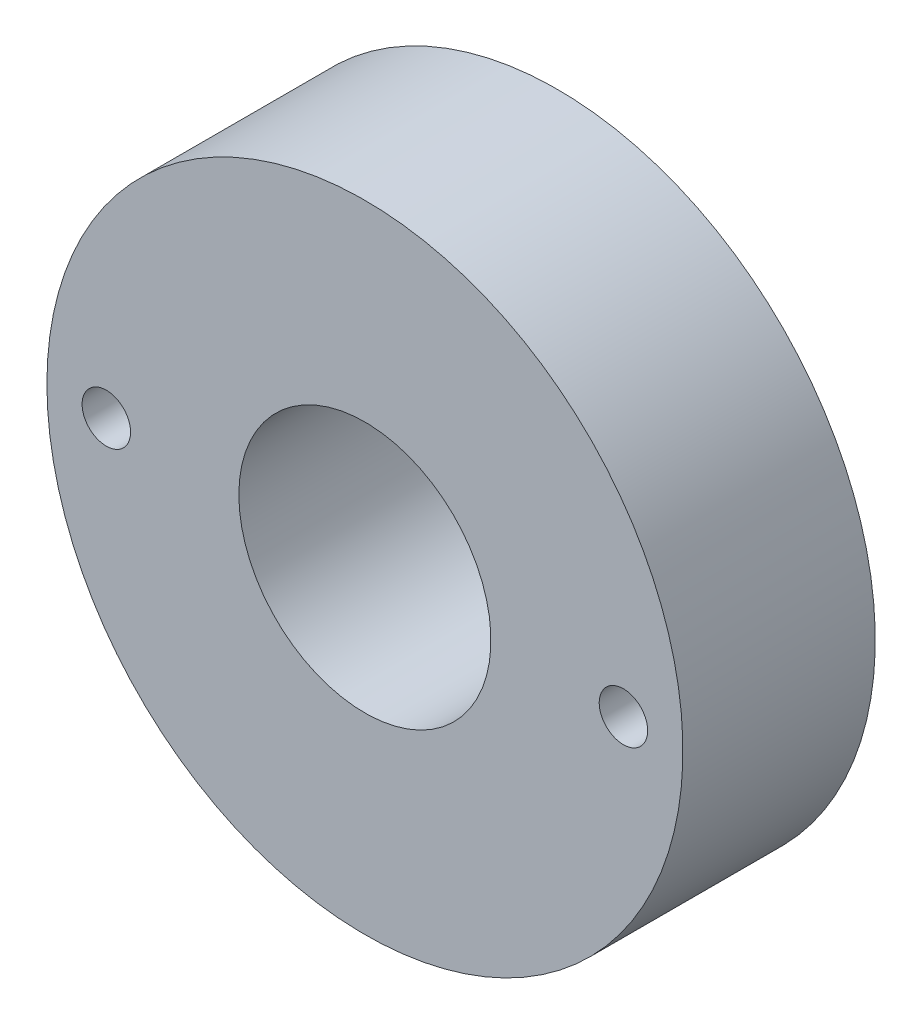
ISO-10303-21;
HEADER;
FILE_DESCRIPTION(('STEP AP214'),'2;1');
FILE_NAME('part.step','',(''),(''),'','','');
FILE_SCHEMA(('AUTOMOTIVE_DESIGN { 1 0 10303 214 1 1 1 1 }'));
ENDSEC;
DATA;
#1=APPLICATION_CONTEXT('core data for automotive mechanical design processes');
#2=APPLICATION_PROTOCOL_DEFINITION('international standard','automotive_design',2000,#1);
#3=PRODUCT_CONTEXT('',#1,'mechanical');
#4=PRODUCT('Part','Part','',(#3));
#5=PRODUCT_RELATED_PRODUCT_CATEGORY('part','',(#4));
#6=PRODUCT_DEFINITION_FORMATION('','',#4);
#7=PRODUCT_DEFINITION_CONTEXT('part definition',#1,'design');
#8=PRODUCT_DEFINITION('design','',#6,#7);
#9=PRODUCT_DEFINITION_SHAPE('','',#8);
#10=(LENGTH_UNIT() NAMED_UNIT(*) SI_UNIT(.MILLI.,.METRE.));
#11=(NAMED_UNIT(*) PLANE_ANGLE_UNIT() SI_UNIT($,.RADIAN.));
#12=(NAMED_UNIT(*) SI_UNIT($,.STERADIAN.) SOLID_ANGLE_UNIT());
#13=UNCERTAINTY_MEASURE_WITH_UNIT(LENGTH_MEASURE(1.E-05),#10,'distance_accuracy_value','');
#14=(GEOMETRIC_REPRESENTATION_CONTEXT(3) GLOBAL_UNCERTAINTY_ASSIGNED_CONTEXT((#13)) GLOBAL_UNIT_ASSIGNED_CONTEXT((#10,
#11,#12)) REPRESENTATION_CONTEXT('',''));
#15=CARTESIAN_POINT('',(0.,0.,0.));
#16=DIRECTION('',(0.,0.,1.));
#17=DIRECTION('',(1.,0.,0.));
#18=AXIS2_PLACEMENT_3D('',#15,#16,#17);
#19=CARTESIAN_POINT('',(657.422182148307,471.1394946,30.1752));
#20=DIRECTION('',(0.,0.,-1.));
#21=DIRECTION('',(-1.,0.,0.));
#22=AXIS2_PLACEMENT_3D('',#19,#20,#21);
#23=CYLINDRICAL_SURFACE('',#22,4.7625);
#24=CARTESIAN_POINT('',(657.422182148307,471.1394946,37.7952));
#25=DIRECTION('',(0.,0.,-1.));
#26=DIRECTION('',(-1.,0.,0.));
#27=AXIS2_PLACEMENT_3D('',#24,#25,#26);
#28=CIRCLE('',#27,4.7625);
#29=CARTESIAN_POINT('',(652.659682148307,471.1394946,37.7952));
#30=VERTEX_POINT('',#29);
#31=EDGE_CURVE('E113',#30,#30,#28,.T.);
#32=ORIENTED_EDGE('',*,*,#31,.F.);
#33=EDGE_LOOP('',(#32));
#34=FACE_BOUND('',#33,.T.);
#35=CARTESIAN_POINT('',(657.422182148307,471.1394946,30.1752));
#36=DIRECTION('',(0.,0.,-1.));
#37=DIRECTION('',(-1.,0.,0.));
#38=AXIS2_PLACEMENT_3D('',#35,#36,#37);
#39=CIRCLE('',#38,4.7625);
#40=CARTESIAN_POINT('',(652.659682148307,471.1394946,30.1752));
#41=VERTEX_POINT('',#40);
#42=EDGE_CURVE('E19',#41,#41,#39,.F.);
#43=ORIENTED_EDGE('',*,*,#42,.F.);
#44=EDGE_LOOP('',(#43));
#45=FACE_BOUND('',#44,.T.);
#46=ADVANCED_FACE('F16',(#34,#45),#23,.F.);
#47=CARTESIAN_POINT('',(555.822182148307,471.1394946,30.1752));
#48=DIRECTION('',(0.,0.,-1.));
#49=DIRECTION('',(-1.,0.,0.));
#50=AXIS2_PLACEMENT_3D('',#47,#48,#49);
#51=CYLINDRICAL_SURFACE('',#50,4.7625);
#52=CARTESIAN_POINT('',(555.822182148307,471.1394946,37.7952));
#53=DIRECTION('',(0.,0.,-1.));
#54=DIRECTION('',(-1.,0.,0.));
#55=AXIS2_PLACEMENT_3D('',#52,#53,#54);
#56=CIRCLE('',#55,4.7625);
#57=CARTESIAN_POINT('',(551.059682148307,471.1394946,37.7952));
#58=VERTEX_POINT('',#57);
#59=EDGE_CURVE('E110',#58,#58,#56,.T.);
#60=ORIENTED_EDGE('',*,*,#59,.F.);
#61=EDGE_LOOP('',(#60));
#62=FACE_BOUND('',#61,.T.);
#63=CARTESIAN_POINT('',(555.822182148307,471.1394946,30.1752));
#64=DIRECTION('',(0.,0.,-1.));
#65=DIRECTION('',(-1.,0.,0.));
#66=AXIS2_PLACEMENT_3D('',#63,#64,#65);
#67=CIRCLE('',#66,4.7625);
#68=CARTESIAN_POINT('',(551.059682148307,471.1394946,30.1752));
#69=VERTEX_POINT('',#68);
#70=EDGE_CURVE('E115',#69,#69,#67,.F.);
#71=ORIENTED_EDGE('',*,*,#70,.F.);
#72=EDGE_LOOP('',(#71));
#73=FACE_BOUND('',#72,.T.);
#74=ADVANCED_FACE('F126',(#62,#73),#51,.F.);
#75=CARTESIAN_POINT('',(657.422105948307,471.1394438,30.1751999999997));
#76=DIRECTION('',(0.,0.,1.));
#77=DIRECTION('',(1.,0.,0.));
#78=AXIS2_PLACEMENT_3D('',#75,#76,#77);
#79=PLANE('',#78);
#80=ORIENTED_EDGE('',*,*,#42,.T.);
#81=EDGE_LOOP('',(#80));
#82=FACE_BOUND('',#81,.T.);
#83=CARTESIAN_POINT('',(657.422029748307,471.1394946,30.1752));
#84=DIRECTION('',(0.,0.,-1.));
#85=DIRECTION('',(-1.,0.,0.));
#86=AXIS2_PLACEMENT_3D('',#83,#84,#85);
#87=CIRCLE('',#86,3.175);
#88=CARTESIAN_POINT('',(654.247029748307,471.1394946,30.1752));
#89=VERTEX_POINT('',#88);
#90=EDGE_CURVE('E106',#89,#89,#87,.T.);
#91=ORIENTED_EDGE('',*,*,#90,.T.);
#92=EDGE_LOOP('',(#91));
#93=FACE_BOUND('',#92,.T.);
#94=ADVANCED_FACE('F122',(#82,#93),#79,.T.);
#95=CARTESIAN_POINT('',(555.822182148307,471.1394946,30.1752));
#96=DIRECTION('',(0.,0.,1.));
#97=DIRECTION('',(1.,0.,0.));
#98=AXIS2_PLACEMENT_3D('',#95,#96,#97);
#99=PLANE('',#98);
#100=ORIENTED_EDGE('',*,*,#70,.T.);
#101=EDGE_LOOP('',(#100));
#102=FACE_BOUND('',#101,.T.);
#103=CARTESIAN_POINT('',(555.822182148307,471.1394946,30.1752));
#104=DIRECTION('',(0.,0.,1.));
#105=DIRECTION('',(1.,0.,0.));
#106=AXIS2_PLACEMENT_3D('',#103,#104,#105);
#107=CIRCLE('',#106,3.175);
#108=CARTESIAN_POINT('',(558.997182148307,471.1394946,30.1752));
#109=VERTEX_POINT('',#108);
#110=EDGE_CURVE('E103',#109,#109,#107,.F.);
#111=ORIENTED_EDGE('',*,*,#110,.T.);
#112=EDGE_LOOP('',(#111));
#113=FACE_BOUND('',#112,.T.);
#114=ADVANCED_FACE('F44',(#102,#113),#99,.T.);
#115=CARTESIAN_POINT('',(606.622232948307,532.26474700002,37.7952));
#116=DIRECTION('',(0.,0.,1.));
#117=DIRECTION('',(1.,0.,0.));
#118=AXIS2_PLACEMENT_3D('',#115,#116,#117);
#119=PLANE('',#118);
#120=ORIENTED_EDGE('',*,*,#59,.T.);
#121=EDGE_LOOP('',(#120));
#122=FACE_BOUND('',#121,.T.);
#123=ORIENTED_EDGE('',*,*,#31,.T.);
#124=EDGE_LOOP('',(#123));
#125=FACE_BOUND('',#124,.T.);
#126=CARTESIAN_POINT('',(606.622105948307,471.1394438,37.7952));
#127=DIRECTION('',(0.,0.,-1.));
#128=DIRECTION('',(-1.,0.,0.));
#129=AXIS2_PLACEMENT_3D('',#126,#127,#128);
#130=CIRCLE('',#129,24.7649238000521);
#131=CARTESIAN_POINT('',(581.857182148255,471.1394438,37.7952));
#132=VERTEX_POINT('',#131);
#133=EDGE_CURVE('E100',#132,#132,#130,.T.);
#134=ORIENTED_EDGE('',*,*,#133,.T.);
#135=EDGE_LOOP('',(#134));
#136=FACE_BOUND('',#135,.T.);
#137=CARTESIAN_POINT('',(606.6282,471.1393676,37.7952));
#138=DIRECTION('',(0.,0.,-1.));
#139=DIRECTION('',(-1.,0.,0.));
#140=AXIS2_PLACEMENT_3D('',#137,#138,#139);
#141=CIRCLE('',#140,62.484);
#142=CARTESIAN_POINT('',(544.1442,471.1393676,37.7952));
#143=VERTEX_POINT('',#142);
#144=EDGE_CURVE('E83',#143,#143,#141,.T.);
#145=ORIENTED_EDGE('',*,*,#144,.F.);
#146=EDGE_LOOP('',(#145));
#147=FACE_BOUND('',#146,.T.);
#148=ADVANCED_FACE('F34',(#122,#125,#136,#147),#119,.T.);
#149=CARTESIAN_POINT('',(606.622105948307,420.3394438,7.62002457634027));
#150=DIRECTION('',(0.,0.,-1.));
#151=DIRECTION('',(0.,1.,0.));
#152=AXIS2_PLACEMENT_3D('',#149,#150,#151);
#153=CONICAL_SURFACE('',#152,3.17499960539165,1.12395138465965);
#154=CARTESIAN_POINT('',(606.622105948307,420.3394438,7.62002793637213));
#155=DIRECTION('',(0.,0.,-1.));
#156=DIRECTION('',(0.,1.,0.));
#157=AXIS2_PLACEMENT_3D('',#154,#155,#156);
#158=CIRCLE('',#157,3.17499259319574);
#159=CARTESIAN_POINT('',(606.622105948307,423.514436393196,7.62002793637214));
#160=VERTEX_POINT('',#159);
#161=EDGE_CURVE('E95',#160,#160,#158,.T.);
#162=ORIENTED_EDGE('',*,*,#161,.T.);
#163=EDGE_LOOP('',(#162));
#164=FACE_BOUND('',#163,.T.);
#165=CARTESIAN_POINT('',(606.622105948307,420.339443799918,9.14138821100607));
#166=VERTEX_POINT('',#165);
#167=VERTEX_LOOP('',#166);
#168=FACE_BOUND('',#167,.T.);
#169=ADVANCED_FACE('F31',(#164,#168),#153,.F.);
#170=CARTESIAN_POINT('',(606.622182148307,521.9394946,7.6200254000014));
#171=DIRECTION('',(0.,0.,-1.));
#172=DIRECTION('',(0.,1.,0.));
#173=AXIS2_PLACEMENT_3D('',#170,#171,#172);
#174=CONICAL_SURFACE('',#173,3.17499788637372,1.12395138465357);
#175=CARTESIAN_POINT('',(606.622182148307,521.9394946,9.14138821099186));
#176=VERTEX_POINT('',#175);
#177=VERTEX_LOOP('',#176);
#178=FACE_BOUND('',#177,.T.);
#179=CARTESIAN_POINT('',(606.622182148307,521.9394946,7.62002793633195));
#180=DIRECTION('',(0.,0.,-1.));
#181=DIRECTION('',(0.,1.,0.));
#182=AXIS2_PLACEMENT_3D('',#179,#180,#181);
#183=CIRCLE('',#182,3.17499259319574);
#184=CARTESIAN_POINT('',(606.622182148307,525.114487193196,7.62002793633196));
#185=VERTEX_POINT('',#184);
#186=EDGE_CURVE('E89',#185,#185,#183,.T.);
#187=ORIENTED_EDGE('',*,*,#186,.T.);
#188=EDGE_LOOP('',(#187));
#189=FACE_BOUND('',#188,.T.);
#190=ADVANCED_FACE('F33',(#178,#189),#174,.F.);
#191=CARTESIAN_POINT('',(606.6282,471.1393676,0.));
#192=DIRECTION('',(0.,0.,-1.));
#193=DIRECTION('',(-1.,0.,0.));
#194=AXIS2_PLACEMENT_3D('',#191,#192,#193);
#195=CYLINDRICAL_SURFACE('',#194,62.484);
#196=ORIENTED_EDGE('',*,*,#144,.T.);
#197=EDGE_LOOP('',(#196));
#198=FACE_BOUND('',#197,.T.);
#199=CARTESIAN_POINT('',(606.6282,471.1393676,0.));
#200=DIRECTION('',(0.,0.,-1.));
#201=DIRECTION('',(-1.,0.,0.));
#202=AXIS2_PLACEMENT_3D('',#199,#200,#201);
#203=CIRCLE('',#202,62.484);
#204=CARTESIAN_POINT('',(544.1442,471.1393676,0.));
#205=VERTEX_POINT('',#204);
#206=EDGE_CURVE('E86',#205,#205,#203,.T.);
#207=ORIENTED_EDGE('',*,*,#206,.F.);
#208=EDGE_LOOP('',(#207));
#209=FACE_BOUND('',#208,.T.);
#210=ADVANCED_FACE('F42',(#198,#209),#195,.T.);
#211=CARTESIAN_POINT('',(657.422029748307,471.1394946,15.0876));
#212=DIRECTION('',(0.,0.,-1.));
#213=DIRECTION('',(-1.,0.,0.));
#214=AXIS2_PLACEMENT_3D('',#211,#212,#213);
#215=CYLINDRICAL_SURFACE('',#214,3.175);
#216=CARTESIAN_POINT('',(657.422029748307,471.1394946,0.));
#217=DIRECTION('',(0.,0.,-1.));
#218=DIRECTION('',(-1.,0.,0.));
#219=AXIS2_PLACEMENT_3D('',#216,#217,#218);
#220=CIRCLE('',#219,3.175);
#221=CARTESIAN_POINT('',(654.247029748307,471.1394946,0.));
#222=VERTEX_POINT('',#221);
#223=EDGE_CURVE('E88',#222,#222,#220,.F.);
#224=ORIENTED_EDGE('',*,*,#223,.F.);
#225=EDGE_LOOP('',(#224));
#226=FACE_BOUND('',#225,.T.);
#227=ORIENTED_EDGE('',*,*,#90,.F.);
#228=EDGE_LOOP('',(#227));
#229=FACE_BOUND('',#228,.T.);
#230=ADVANCED_FACE('F71',(#226,#229),#215,.F.);
#231=CARTESIAN_POINT('',(555.822182148307,471.1394946,15.0876));
#232=DIRECTION('',(0.,0.,1.));
#233=DIRECTION('',(1.,0.,0.));
#234=AXIS2_PLACEMENT_3D('',#231,#232,#233);
#235=CYLINDRICAL_SURFACE('',#234,3.175);
#236=CARTESIAN_POINT('',(555.822182148307,471.1394946,0.));
#237=DIRECTION('',(0.,0.,1.));
#238=DIRECTION('',(1.,0.,0.));
#239=AXIS2_PLACEMENT_3D('',#236,#237,#238);
#240=CIRCLE('',#239,3.175);
#241=CARTESIAN_POINT('',(558.997182148307,471.1394946,0.));
#242=VERTEX_POINT('',#241);
#243=EDGE_CURVE('E92',#242,#242,#240,.T.);
#244=ORIENTED_EDGE('',*,*,#243,.F.);
#245=EDGE_LOOP('',(#244));
#246=FACE_BOUND('',#245,.T.);
#247=ORIENTED_EDGE('',*,*,#110,.F.);
#248=EDGE_LOOP('',(#247));
#249=FACE_BOUND('',#248,.T.);
#250=ADVANCED_FACE('F67',(#246,#249),#235,.F.);
#251=CARTESIAN_POINT('',(606.622105948307,471.1394438,0.));
#252=DIRECTION('',(0.,0.,-1.));
#253=DIRECTION('',(-1.,0.,0.));
#254=AXIS2_PLACEMENT_3D('',#251,#252,#253);
#255=CYLINDRICAL_SURFACE('',#254,24.7649238000521);
#256=CARTESIAN_POINT('',(606.622105948307,471.1394438,0.));
#257=DIRECTION('',(0.,0.,-1.));
#258=DIRECTION('',(-1.,0.,0.));
#259=AXIS2_PLACEMENT_3D('',#256,#257,#258);
#260=CIRCLE('',#259,24.7649238000521);
#261=CARTESIAN_POINT('',(581.857182148255,471.1394438,0.));
#262=VERTEX_POINT('',#261);
#263=EDGE_CURVE('E206',#262,#262,#260,.F.);
#264=ORIENTED_EDGE('',*,*,#263,.F.);
#265=EDGE_LOOP('',(#264));
#266=FACE_BOUND('',#265,.T.);
#267=ORIENTED_EDGE('',*,*,#133,.F.);
#268=EDGE_LOOP('',(#267));
#269=FACE_BOUND('',#268,.T.);
#270=ADVANCED_FACE('F63',(#266,#269),#255,.F.);
#271=CARTESIAN_POINT('',(606.622105948307,420.3394438,3.81001269999632));
#272=DIRECTION('',(0.,0.,-1.));
#273=DIRECTION('',(0.,1.,0.));
#274=AXIS2_PLACEMENT_3D('',#271,#272,#273);
#275=CYLINDRICAL_SURFACE('',#274,3.17499259319574);
#276=ORIENTED_EDGE('',*,*,#161,.F.);
#277=EDGE_LOOP('',(#276));
#278=FACE_BOUND('',#277,.T.);
#279=CARTESIAN_POINT('',(606.622105948307,420.3394438,-1.29670579829266E-13));
#280=DIRECTION('',(0.,0.,-1.));
#281=DIRECTION('',(0.,1.,0.));
#282=AXIS2_PLACEMENT_3D('',#279,#280,#281);
#283=CIRCLE('',#282,3.17499259319574);
#284=CARTESIAN_POINT('',(606.622105948307,423.514436393196,-1.21605288394131E-13));
#285=VERTEX_POINT('',#284);
#286=EDGE_CURVE('E25',#285,#285,#283,.F.);
#287=ORIENTED_EDGE('',*,*,#286,.F.);
#288=EDGE_LOOP('',(#287));
#289=FACE_BOUND('',#288,.T.);
#290=ADVANCED_FACE('F56',(#278,#289),#275,.F.);
#291=CARTESIAN_POINT('',(606.622182148307,521.9394946,3.81001269999632));
#292=DIRECTION('',(0.,0.,-1.));
#293=DIRECTION('',(0.,1.,0.));
#294=AXIS2_PLACEMENT_3D('',#291,#292,#293);
#295=CYLINDRICAL_SURFACE('',#294,3.17499259319574);
#296=CARTESIAN_POINT('',(606.622182148307,521.9394946,0.));
#297=DIRECTION('',(0.,0.,-1.));
#298=DIRECTION('',(0.,1.,0.));
#299=AXIS2_PLACEMENT_3D('',#296,#297,#298);
#300=CIRCLE('',#299,3.17499259319574);
#301=CARTESIAN_POINT('',(606.622182148307,525.114487193196,0.));
#302=VERTEX_POINT('',#301);
#303=EDGE_CURVE('E11',#302,#302,#300,.F.);
#304=ORIENTED_EDGE('',*,*,#303,.F.);
#305=EDGE_LOOP('',(#304));
#306=FACE_BOUND('',#305,.T.);
#307=ORIENTED_EDGE('',*,*,#186,.F.);
#308=EDGE_LOOP('',(#307));
#309=FACE_BOUND('',#308,.T.);
#310=ADVANCED_FACE('F50',(#306,#309),#295,.F.);
#311=CARTESIAN_POINT('',(657.422105948307,471.1394438,-1.29718458197203E-13));
#312=DIRECTION('',(0.,0.,-1.));
#313=DIRECTION('',(-1.,0.,0.));
#314=AXIS2_PLACEMENT_3D('',#311,#312,#313);
#315=PLANE('',#314);
#316=ORIENTED_EDGE('',*,*,#303,.T.);
#317=EDGE_LOOP('',(#316));
#318=FACE_BOUND('',#317,.T.);
#319=ORIENTED_EDGE('',*,*,#286,.T.);
#320=EDGE_LOOP('',(#319));
#321=FACE_BOUND('',#320,.T.);
#322=ORIENTED_EDGE('',*,*,#263,.T.);
#323=EDGE_LOOP('',(#322));
#324=FACE_BOUND('',#323,.T.);
#325=ORIENTED_EDGE('',*,*,#243,.T.);
#326=EDGE_LOOP('',(#325));
#327=FACE_BOUND('',#326,.T.);
#328=ORIENTED_EDGE('',*,*,#223,.T.);
#329=EDGE_LOOP('',(#328));
#330=FACE_BOUND('',#329,.T.);
#331=ORIENTED_EDGE('',*,*,#206,.T.);
#332=EDGE_LOOP('',(#331));
#333=FACE_BOUND('',#332,.T.);
#334=ADVANCED_FACE('F48',(#318,#321,#324,#327,#330,#333),#315,.T.);
#335=CLOSED_SHELL('',(#46,#74,#94,#114,#148,#169,#190,#210,#230,#250,#270,#290,#310,#334));
#336=MANIFOLD_SOLID_BREP('B1',#335);
#337=ADVANCED_BREP_SHAPE_REPRESENTATION('',(#18,#336),#14);
#338=SHAPE_DEFINITION_REPRESENTATION(#9,#337);
ENDSEC;
END-ISO-10303-21;
